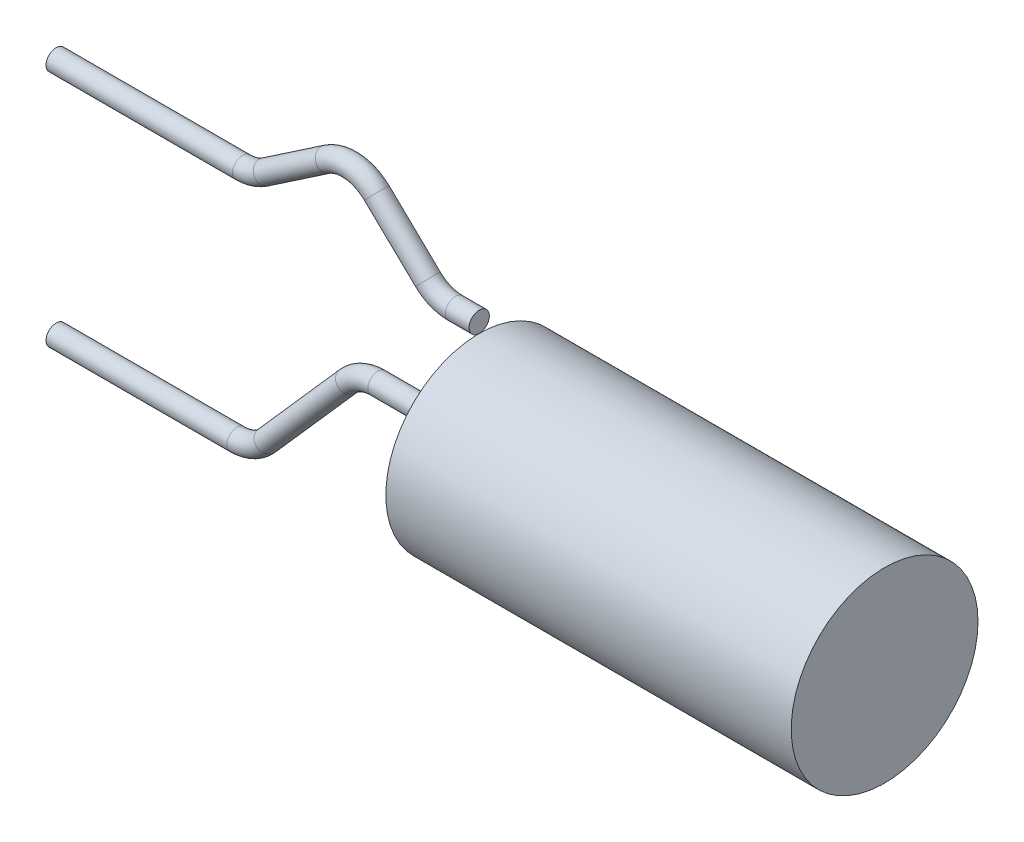
ISO-10303-21;
HEADER;
FILE_DESCRIPTION(('STEP AP214'),'2;1');
FILE_NAME('part.step','',(''),(''),'','','');
FILE_SCHEMA(('AUTOMOTIVE_DESIGN { 1 0 10303 214 1 1 1 1 }'));
ENDSEC;
DATA;
#1=APPLICATION_CONTEXT('core data for automotive mechanical design processes');
#2=APPLICATION_PROTOCOL_DEFINITION('international standard','automotive_design',2000,#1);
#3=PRODUCT_CONTEXT('',#1,'mechanical');
#4=PRODUCT('Part','Part','',(#3));
#5=PRODUCT_RELATED_PRODUCT_CATEGORY('part','',(#4));
#6=PRODUCT_DEFINITION_FORMATION('','',#4);
#7=PRODUCT_DEFINITION_CONTEXT('part definition',#1,'design');
#8=PRODUCT_DEFINITION('design','',#6,#7);
#9=PRODUCT_DEFINITION_SHAPE('','',#8);
#10=(LENGTH_UNIT() NAMED_UNIT(*) SI_UNIT(.MILLI.,.METRE.));
#11=(NAMED_UNIT(*) PLANE_ANGLE_UNIT() SI_UNIT($,.RADIAN.));
#12=(NAMED_UNIT(*) SI_UNIT($,.STERADIAN.) SOLID_ANGLE_UNIT());
#13=UNCERTAINTY_MEASURE_WITH_UNIT(LENGTH_MEASURE(1.E-05),#10,'distance_accuracy_value','');
#14=(GEOMETRIC_REPRESENTATION_CONTEXT(3) GLOBAL_UNCERTAINTY_ASSIGNED_CONTEXT((#13)) GLOBAL_UNIT_ASSIGNED_CONTEXT((#10,
#11,#12)) REPRESENTATION_CONTEXT('',''));
#15=CARTESIAN_POINT('',(0.,0.,0.));
#16=DIRECTION('',(0.,0.,1.));
#17=DIRECTION('',(1.,0.,0.));
#18=AXIS2_PLACEMENT_3D('',#15,#16,#17);
#19=CARTESIAN_POINT('',(-16.1528726238356,3.,0.));
#20=DIRECTION('',(-1.,0.,0.));
#21=DIRECTION('',(0.,-1.,0.));
#22=AXIS2_PLACEMENT_3D('',#19,#20,#21);
#23=CYLINDRICAL_SURFACE('',#22,0.255);
#24=CARTESIAN_POINT('',(-16.1528726238356,3.,0.));
#25=DIRECTION('',(-1.,0.,0.));
#26=DIRECTION('',(0.,0.,1.));
#27=AXIS2_PLACEMENT_3D('',#24,#25,#26);
#28=CIRCLE('',#27,0.255);
#29=CARTESIAN_POINT('',(-16.1528726238356,2.745,0.));
#30=VERTEX_POINT('',#29);
#31=EDGE_CURVE('E53',#30,#30,#28,.T.);
#32=ORIENTED_EDGE('',*,*,#31,.T.);
#33=EDGE_LOOP('',(#32));
#34=FACE_BOUND('',#33,.T.);
#35=CARTESIAN_POINT('',(-20.8457513110646,3.,0.));
#36=DIRECTION('',(-1.,0.,0.));
#37=DIRECTION('',(0.,0.,1.));
#38=AXIS2_PLACEMENT_3D('',#35,#36,#37);
#39=CIRCLE('',#38,0.255);
#40=CARTESIAN_POINT('',(-20.8457513110646,3.,0.255));
#41=VERTEX_POINT('',#40);
#42=EDGE_CURVE('E11',#41,#41,#39,.T.);
#43=ORIENTED_EDGE('',*,*,#42,.F.);
#44=EDGE_LOOP('',(#43));
#45=FACE_BOUND('',#44,.T.);
#46=ADVANCED_FACE('F47',(#34,#45),#23,.T.);
#47=CARTESIAN_POINT('',(-16.1528726238356,4.,0.));
#48=DIRECTION('',(0.,0.,-1.));
#49=DIRECTION('',(-1.,0.,0.));
#50=AXIS2_PLACEMENT_3D('',#47,#48,#49);
#51=TOROIDAL_SURFACE('',#50,0.999999999999998,0.255);
#52=CARTESIAN_POINT('',(-15.5915736796784,3.17238686858651,0.));
#53=DIRECTION('',(-0.827613131413487,-0.561298944157178,0.));
#54=DIRECTION('',(0.,0.,1.));
#55=AXIS2_PLACEMENT_3D('',#52,#53,#54);
#56=CIRCLE('',#55,0.255);
#57=CARTESIAN_POINT('',(-15.4484424489183,2.96134552007607,0.));
#58=VERTEX_POINT('',#57);
#59=EDGE_CURVE('E57',#58,#58,#56,.T.);
#60=CARTESIAN_POINT('',(-16.1528726238356,4.,0.));
#61=DIRECTION('',(0.,0.,-1.));
#62=DIRECTION('',(-1.,0.,0.));
#63=AXIS2_PLACEMENT_3D('',#60,#61,#62);
#64=CIRCLE('',#63,1.255);
#65=EDGE_CURVE('',#58,#30,#64,.T.);
#66=ORIENTED_EDGE('',*,*,#59,.T.);
#67=ORIENTED_EDGE('',*,*,#31,.F.);
#68=ORIENTED_EDGE('',*,*,#65,.T.);
#69=ORIENTED_EDGE('',*,*,#65,.F.);
#70=EDGE_LOOP('',(#66,#68,#67,#69));
#71=FACE_BOUND('',#70,.T.);
#72=ADVANCED_FACE('F90',(#71),#51,.T.);
#73=CARTESIAN_POINT('',(-14.0332313634311,4.2292766925205,0.));
#74=DIRECTION('',(-0.827613131413487,-0.561298944157178,0.));
#75=DIRECTION('',(0.561298944157178,-0.827613131413487,0.));
#76=AXIS2_PLACEMENT_3D('',#73,#74,#75);
#77=CYLINDRICAL_SURFACE('',#76,0.255);
#78=CARTESIAN_POINT('',(-14.0332313634311,4.2292766925205,0.));
#79=DIRECTION('',(-0.827613131413487,-0.561298944157178,0.));
#80=DIRECTION('',(0.,0.,1.));
#81=AXIS2_PLACEMENT_3D('',#78,#79,#80);
#82=CIRCLE('',#81,0.255);
#83=CARTESIAN_POINT('',(-14.1763625941912,4.44031804103094,0.));
#84=VERTEX_POINT('',#83);
#85=EDGE_CURVE('E61',#84,#84,#82,.T.);
#86=ORIENTED_EDGE('',*,*,#85,.T.);
#87=EDGE_LOOP('',(#86));
#88=FACE_BOUND('',#87,.T.);
#89=ORIENTED_EDGE('',*,*,#59,.F.);
#90=EDGE_LOOP('',(#89));
#91=FACE_BOUND('',#90,.T.);
#92=ADVANCED_FACE('F94',(#88,#91),#77,.T.);
#93=CARTESIAN_POINT('',(-13.4719324192739,3.40166356110702,0.));
#94=DIRECTION('',(0.,0.,1.));
#95=DIRECTION('',(1.,0.,0.));
#96=AXIS2_PLACEMENT_3D('',#93,#94,#95);
#97=TOROIDAL_SURFACE('',#96,1.,0.255);
#98=CARTESIAN_POINT('',(-12.7789668084501,4.12263420004839,0.));
#99=DIRECTION('',(-0.720970638941377,0.692965610823844,0.));
#100=DIRECTION('',(0.,0.,1.));
#101=AXIS2_PLACEMENT_3D('',#98,#99,#100);
#102=CIRCLE('',#101,0.255);
#103=CARTESIAN_POINT('',(-12.60226057769,4.30648171297844,0.));
#104=VERTEX_POINT('',#103);
#105=EDGE_CURVE('E66',#104,#104,#102,.T.);
#106=CARTESIAN_POINT('',(-13.4719324192739,3.40166356110702,0.));
#107=DIRECTION('',(0.,0.,1.));
#108=DIRECTION('',(1.,0.,0.));
#109=AXIS2_PLACEMENT_3D('',#106,#107,#108);
#110=CIRCLE('',#109,1.255);
#111=EDGE_CURVE('',#104,#84,#110,.T.);
#112=ORIENTED_EDGE('',*,*,#105,.T.);
#113=ORIENTED_EDGE('',*,*,#85,.F.);
#114=ORIENTED_EDGE('',*,*,#111,.T.);
#115=ORIENTED_EDGE('',*,*,#111,.F.);
#116=EDGE_LOOP('',(#112,#114,#113,#115));
#117=FACE_BOUND('',#116,.T.);
#118=ADVANCED_FACE('F100',(#117),#97,.T.);
#119=CARTESIAN_POINT('',(-11.4903058587376,2.88402936105862,0.));
#120=DIRECTION('',(-0.720970638941376,0.692965610823844,0.));
#121=DIRECTION('',(-0.692965610823844,-0.720970638941376,0.));
#122=AXIS2_PLACEMENT_3D('',#119,#120,#121);
#123=CYLINDRICAL_SURFACE('',#122,0.255);
#124=CARTESIAN_POINT('',(-11.4903058587376,2.88402936105862,0.));
#125=DIRECTION('',(-0.720970638941377,0.692965610823844,0.));
#126=DIRECTION('',(0.,0.,1.));
#127=AXIS2_PLACEMENT_3D('',#124,#125,#126);
#128=CIRCLE('',#127,0.255);
#129=CARTESIAN_POINT('',(-11.6670120894977,2.70018184812857,0.));
#130=VERTEX_POINT('',#129);
#131=EDGE_CURVE('E69',#130,#130,#128,.T.);
#132=ORIENTED_EDGE('',*,*,#131,.T.);
#133=EDGE_LOOP('',(#132));
#134=FACE_BOUND('',#133,.T.);
#135=ORIENTED_EDGE('',*,*,#105,.F.);
#136=EDGE_LOOP('',(#135));
#137=FACE_BOUND('',#136,.T.);
#138=ADVANCED_FACE('F107',(#134,#137),#123,.T.);
#139=CARTESIAN_POINT('',(-10.7973402479138,3.605,0.));
#140=DIRECTION('',(0.,0.,-1.));
#141=DIRECTION('',(-1.,0.,0.));
#142=AXIS2_PLACEMENT_3D('',#139,#140,#141);
#143=TOROIDAL_SURFACE('',#142,1.,0.255);
#144=CARTESIAN_POINT('',(-10.7973402479138,2.605,0.));
#145=DIRECTION('',(-1.,0.,0.));
#146=DIRECTION('',(0.,0.,1.));
#147=AXIS2_PLACEMENT_3D('',#144,#145,#146);
#148=CIRCLE('',#147,0.255);
#149=CARTESIAN_POINT('',(-10.7973402479138,2.35,0.));
#150=VERTEX_POINT('',#149);
#151=EDGE_CURVE('E72',#150,#150,#148,.T.);
#152=CARTESIAN_POINT('',(-10.7973402479138,3.605,0.));
#153=DIRECTION('',(0.,0.,-1.));
#154=DIRECTION('',(-1.,0.,0.));
#155=AXIS2_PLACEMENT_3D('',#152,#153,#154);
#156=CIRCLE('',#155,1.255);
#157=EDGE_CURVE('',#150,#130,#156,.T.);
#158=ORIENTED_EDGE('',*,*,#151,.T.);
#159=ORIENTED_EDGE('',*,*,#131,.F.);
#160=ORIENTED_EDGE('',*,*,#157,.T.);
#161=ORIENTED_EDGE('',*,*,#157,.F.);
#162=EDGE_LOOP('',(#158,#160,#159,#161));
#163=FACE_BOUND('',#162,.T.);
#164=ADVANCED_FACE('F111',(#163),#143,.T.);
#165=CARTESIAN_POINT('',(-10.7973402479138,2.605,0.));
#166=DIRECTION('',(1.,0.,0.));
#167=DIRECTION('',(0.,1.,0.));
#168=AXIS2_PLACEMENT_3D('',#165,#166,#167);
#169=CYLINDRICAL_SURFACE('',#168,0.255);
#170=ORIENTED_EDGE('',*,*,#151,.F.);
#171=EDGE_LOOP('',(#170));
#172=FACE_BOUND('',#171,.T.);
#173=CARTESIAN_POINT('',(-10.2,2.605,0.));
#174=DIRECTION('',(-1.,0.,0.));
#175=DIRECTION('',(0.,0.,1.));
#176=AXIS2_PLACEMENT_3D('',#173,#174,#175);
#177=CIRCLE('',#176,0.255);
#178=CARTESIAN_POINT('',(-10.2,2.605,0.255));
#179=VERTEX_POINT('',#178);
#180=EDGE_CURVE('E75',#179,#179,#177,.T.);
#181=ORIENTED_EDGE('',*,*,#180,.T.);
#182=EDGE_LOOP('',(#181));
#183=FACE_BOUND('',#182,.T.);
#184=ADVANCED_FACE('F79',(#172,#183),#169,.T.);
#185=CARTESIAN_POINT('',(-20.8457513110646,3.,0.));
#186=DIRECTION('',(-1.,0.,0.));
#187=DIRECTION('',(0.,0.,1.));
#188=AXIS2_PLACEMENT_3D('',#185,#186,#187);
#189=PLANE('',#188);
#190=ORIENTED_EDGE('',*,*,#42,.T.);
#191=EDGE_LOOP('',(#190));
#192=FACE_BOUND('',#191,.T.);
#193=ADVANCED_FACE('F83',(#192),#189,.T.);
#194=CARTESIAN_POINT('',(-10.2,2.605,0.));
#195=DIRECTION('',(-1.,0.,0.));
#196=DIRECTION('',(0.,0.,1.));
#197=AXIS2_PLACEMENT_3D('',#194,#195,#196);
#198=PLANE('',#197);
#199=ORIENTED_EDGE('',*,*,#180,.F.);
#200=EDGE_LOOP('',(#199));
#201=FACE_BOUND('',#200,.T.);
#202=ADVANCED_FACE('F81',(#201),#198,.F.);
#203=CLOSED_SHELL('',(#46,#72,#92,#118,#138,#164,#184,#193,#202));
#204=MANIFOLD_SOLID_BREP('B2',#203);
#205=CARTESIAN_POINT('',(-10.2,0.,0.));
#206=DIRECTION('',(-1.,0.,0.));
#207=DIRECTION('',(0.,0.,1.));
#208=AXIS2_PLACEMENT_3D('',#205,#206,#207);
#209=PLANE('',#208);
#210=CARTESIAN_POINT('',(-10.2,0.,0.));
#211=DIRECTION('',(-1.,0.,0.));
#212=DIRECTION('',(0.,0.,1.));
#213=AXIS2_PLACEMENT_3D('',#210,#211,#212);
#214=CIRCLE('',#213,0.255);
#215=CARTESIAN_POINT('',(-10.2,0.,0.255));
#216=VERTEX_POINT('',#215);
#217=EDGE_CURVE('E46',#216,#216,#214,.T.);
#218=ORIENTED_EDGE('',*,*,#217,.F.);
#219=EDGE_LOOP('',(#218));
#220=FACE_BOUND('',#219,.T.);
#221=CARTESIAN_POINT('',(-10.2,0.,0.));
#222=DIRECTION('',(1.,0.,0.));
#223=DIRECTION('',(0.,0.,-1.));
#224=AXIS2_PLACEMENT_3D('',#221,#222,#223);
#225=CIRCLE('',#224,2.35);
#226=CARTESIAN_POINT('',(-10.2,0.,-2.35));
#227=VERTEX_POINT('',#226);
#228=EDGE_CURVE('E163',#227,#227,#225,.T.);
#229=ORIENTED_EDGE('',*,*,#228,.F.);
#230=EDGE_LOOP('',(#229));
#231=FACE_BOUND('',#230,.T.);
#232=ADVANCED_FACE('F160',(#220,#231),#209,.T.);
#233=CARTESIAN_POINT('',(0.,0.,0.));
#234=DIRECTION('',(1.,0.,0.));
#235=DIRECTION('',(0.,0.,-1.));
#236=AXIS2_PLACEMENT_3D('',#233,#234,#235);
#237=CYLINDRICAL_SURFACE('',#236,2.35);
#238=ORIENTED_EDGE('',*,*,#228,.T.);
#239=EDGE_LOOP('',(#238));
#240=FACE_BOUND('',#239,.T.);
#241=CARTESIAN_POINT('',(0.,0.,0.));
#242=DIRECTION('',(1.,0.,0.));
#243=DIRECTION('',(0.,0.,-1.));
#244=AXIS2_PLACEMENT_3D('',#241,#242,#243);
#245=CIRCLE('',#244,2.35);
#246=CARTESIAN_POINT('',(0.,0.,-2.35));
#247=VERTEX_POINT('',#246);
#248=EDGE_CURVE('E171',#247,#247,#245,.T.);
#249=ORIENTED_EDGE('',*,*,#248,.F.);
#250=EDGE_LOOP('',(#249));
#251=FACE_BOUND('',#250,.T.);
#252=ADVANCED_FACE('F192',(#240,#251),#237,.T.);
#253=CARTESIAN_POINT('',(0.,0.,0.));
#254=DIRECTION('',(1.,0.,0.));
#255=DIRECTION('',(0.,0.,-1.));
#256=AXIS2_PLACEMENT_3D('',#253,#254,#255);
#257=PLANE('',#256);
#258=ORIENTED_EDGE('',*,*,#248,.T.);
#259=EDGE_LOOP('',(#258));
#260=FACE_BOUND('',#259,.T.);
#261=ADVANCED_FACE('F190',(#260),#257,.T.);
#262=CARTESIAN_POINT('',(-16.2971675407097,-3.,0.));
#263=DIRECTION('',(-1.,0.,0.));
#264=DIRECTION('',(0.,-1.,0.));
#265=AXIS2_PLACEMENT_3D('',#262,#263,#264);
#266=CYLINDRICAL_SURFACE('',#265,0.255);
#267=CARTESIAN_POINT('',(-16.2971675407097,-3.,0.));
#268=DIRECTION('',(-1.,0.,0.));
#269=DIRECTION('',(0.,0.,1.));
#270=AXIS2_PLACEMENT_3D('',#267,#268,#269);
#271=CIRCLE('',#270,0.255);
#272=CARTESIAN_POINT('',(-16.2971675407097,-3.255,0.));
#273=VERTEX_POINT('',#272);
#274=EDGE_CURVE('E182',#273,#273,#271,.T.);
#275=ORIENTED_EDGE('',*,*,#274,.T.);
#276=EDGE_LOOP('',(#275));
#277=FACE_BOUND('',#276,.T.);
#278=CARTESIAN_POINT('',(-20.8457513110646,-3.,0.));
#279=DIRECTION('',(-1.,0.,0.));
#280=DIRECTION('',(0.,0.,1.));
#281=AXIS2_PLACEMENT_3D('',#278,#279,#280);
#282=CIRCLE('',#281,0.255);
#283=CARTESIAN_POINT('',(-20.8457513110646,-3.,0.255));
#284=VERTEX_POINT('',#283);
#285=EDGE_CURVE('E185',#284,#284,#282,.T.);
#286=ORIENTED_EDGE('',*,*,#285,.F.);
#287=EDGE_LOOP('',(#286));
#288=FACE_BOUND('',#287,.T.);
#289=ADVANCED_FACE('F198',(#277,#288),#266,.T.);
#290=CARTESIAN_POINT('',(-16.2971675407097,-2.,0.));
#291=DIRECTION('',(0.,0.,-1.));
#292=DIRECTION('',(-1.,0.,0.));
#293=AXIS2_PLACEMENT_3D('',#290,#291,#292);
#294=TOROIDAL_SURFACE('',#293,0.999999999999998,0.255);
#295=CARTESIAN_POINT('',(-15.5471675407097,-2.66143782776615,0.));
#296=DIRECTION('',(-0.661437827766147,-0.750000000000001,0.));
#297=DIRECTION('',(0.,0.,1.));
#298=AXIS2_PLACEMENT_3D('',#295,#296,#297);
#299=CIRCLE('',#298,0.255);
#300=CARTESIAN_POINT('',(-15.3559175407097,-2.83010447384652,0.));
#301=VERTEX_POINT('',#300);
#302=EDGE_CURVE('E179',#301,#301,#299,.T.);
#303=CARTESIAN_POINT('',(-16.2971675407097,-2.,0.));
#304=DIRECTION('',(0.,0.,-1.));
#305=DIRECTION('',(-1.,0.,0.));
#306=AXIS2_PLACEMENT_3D('',#303,#304,#305);
#307=CIRCLE('',#306,1.255);
#308=EDGE_CURVE('',#301,#273,#307,.T.);
#309=ORIENTED_EDGE('',*,*,#302,.T.);
#310=ORIENTED_EDGE('',*,*,#274,.F.);
#311=ORIENTED_EDGE('',*,*,#308,.T.);
#312=ORIENTED_EDGE('',*,*,#308,.F.);
#313=EDGE_LOOP('',(#309,#311,#310,#312));
#314=FACE_BOUND('',#313,.T.);
#315=ADVANCED_FACE('F205',(#314),#294,.T.);
#316=CARTESIAN_POINT('',(-13.4985837703549,-0.338562172233853,0.));
#317=DIRECTION('',(-0.661437827766148,-0.75,0.));
#318=DIRECTION('',(0.75,-0.661437827766148,0.));
#319=AXIS2_PLACEMENT_3D('',#316,#317,#318);
#320=CYLINDRICAL_SURFACE('',#319,0.255);
#321=CARTESIAN_POINT('',(-13.4985837703549,-0.338562172233853,0.));
#322=DIRECTION('',(-0.661437827766147,-0.750000000000001,0.));
#323=DIRECTION('',(0.,0.,1.));
#324=AXIS2_PLACEMENT_3D('',#321,#322,#323);
#325=CIRCLE('',#324,0.255);
#326=CARTESIAN_POINT('',(-13.6898337703549,-0.169895526153486,0.));
#327=VERTEX_POINT('',#326);
#328=EDGE_CURVE('E176',#327,#327,#325,.T.);
#329=ORIENTED_EDGE('',*,*,#328,.T.);
#330=EDGE_LOOP('',(#329));
#331=FACE_BOUND('',#330,.T.);
#332=ORIENTED_EDGE('',*,*,#302,.F.);
#333=EDGE_LOOP('',(#332));
#334=FACE_BOUND('',#333,.T.);
#335=ADVANCED_FACE('F209',(#331,#334),#320,.T.);
#336=CARTESIAN_POINT('',(-12.7485837703549,-1.,0.));
#337=DIRECTION('',(0.,0.,1.));
#338=DIRECTION('',(1.,0.,0.));
#339=AXIS2_PLACEMENT_3D('',#336,#337,#338);
#340=TOROIDAL_SURFACE('',#339,1.,0.255);
#341=CARTESIAN_POINT('',(-12.7485837703549,0.,0.));
#342=DIRECTION('',(-1.,0.,0.));
#343=DIRECTION('',(0.,0.,1.));
#344=AXIS2_PLACEMENT_3D('',#341,#342,#343);
#345=CIRCLE('',#344,0.255);
#346=CARTESIAN_POINT('',(-12.7485837703549,0.255,0.));
#347=VERTEX_POINT('',#346);
#348=EDGE_CURVE('E173',#347,#347,#345,.T.);
#349=CARTESIAN_POINT('',(-12.7485837703549,-1.,0.));
#350=DIRECTION('',(0.,0.,1.));
#351=DIRECTION('',(1.,0.,0.));
#352=AXIS2_PLACEMENT_3D('',#349,#350,#351);
#353=CIRCLE('',#352,1.255);
#354=EDGE_CURVE('',#347,#327,#353,.T.);
#355=ORIENTED_EDGE('',*,*,#348,.T.);
#356=ORIENTED_EDGE('',*,*,#328,.F.);
#357=ORIENTED_EDGE('',*,*,#354,.T.);
#358=ORIENTED_EDGE('',*,*,#354,.F.);
#359=EDGE_LOOP('',(#355,#357,#356,#358));
#360=FACE_BOUND('',#359,.T.);
#361=ADVANCED_FACE('F213',(#360),#340,.T.);
#362=CARTESIAN_POINT('',(-12.7485837703549,0.,0.));
#363=DIRECTION('',(1.,0.,0.));
#364=DIRECTION('',(0.,1.,0.));
#365=AXIS2_PLACEMENT_3D('',#362,#363,#364);
#366=CYLINDRICAL_SURFACE('',#365,0.255);
#367=ORIENTED_EDGE('',*,*,#348,.F.);
#368=EDGE_LOOP('',(#367));
#369=FACE_BOUND('',#368,.T.);
#370=ORIENTED_EDGE('',*,*,#217,.T.);
#371=EDGE_LOOP('',(#370));
#372=FACE_BOUND('',#371,.T.);
#373=ADVANCED_FACE('F217',(#369,#372),#366,.T.);
#374=CARTESIAN_POINT('',(-20.8457513110646,-3.,0.));
#375=DIRECTION('',(-1.,0.,0.));
#376=DIRECTION('',(0.,0.,1.));
#377=AXIS2_PLACEMENT_3D('',#374,#375,#376);
#378=PLANE('',#377);
#379=ORIENTED_EDGE('',*,*,#285,.T.);
#380=EDGE_LOOP('',(#379));
#381=FACE_BOUND('',#380,.T.);
#382=ADVANCED_FACE('F221',(#381),#378,.T.);
#383=CLOSED_SHELL('',(#232,#252,#261,#289,#315,#335,#361,#373,#382));
#384=MANIFOLD_SOLID_BREP('B6',#383);
#385=ADVANCED_BREP_SHAPE_REPRESENTATION('',(#18,#204,#384),#14);
#386=SHAPE_DEFINITION_REPRESENTATION(#9,#385);
ENDSEC;
END-ISO-10303-21;
